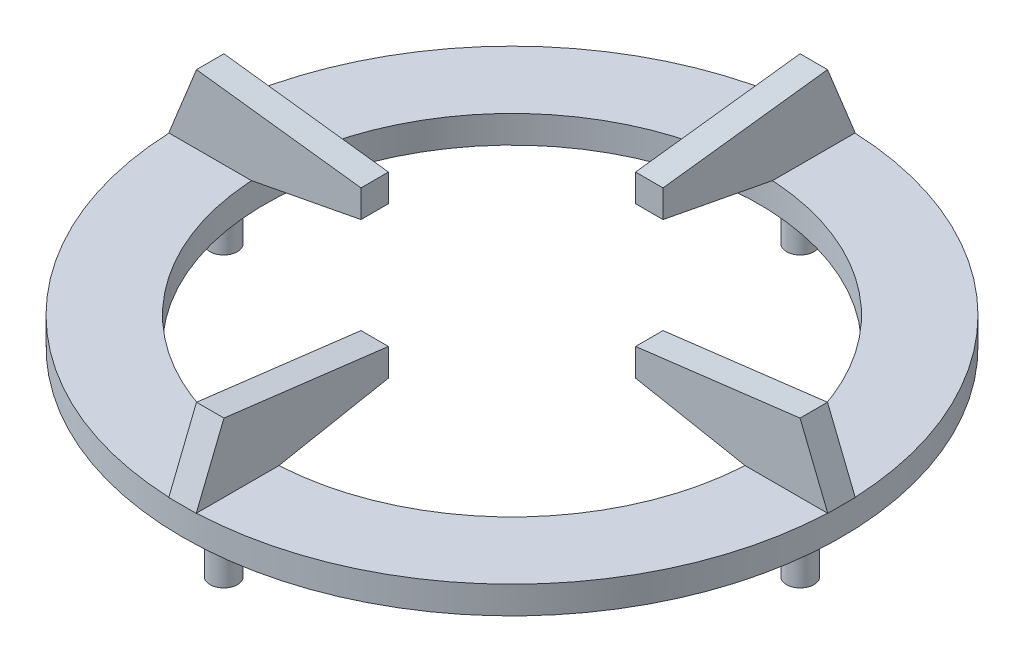
ISO-10303-21;
HEADER;
FILE_DESCRIPTION(('STEP AP214'),'2;1');
FILE_NAME('part.step','',(''),(''),'','','');
FILE_SCHEMA(('AUTOMOTIVE_DESIGN { 1 0 10303 214 1 1 1 1 }'));
ENDSEC;
DATA;
#1=APPLICATION_CONTEXT('core data for automotive mechanical design processes');
#2=APPLICATION_PROTOCOL_DEFINITION('international standard','automotive_design',2000,#1);
#3=PRODUCT_CONTEXT('',#1,'mechanical');
#4=PRODUCT('Part','Part','',(#3));
#5=PRODUCT_RELATED_PRODUCT_CATEGORY('part','',(#4));
#6=PRODUCT_DEFINITION_FORMATION('','',#4);
#7=PRODUCT_DEFINITION_CONTEXT('part definition',#1,'design');
#8=PRODUCT_DEFINITION('design','',#6,#7);
#9=PRODUCT_DEFINITION_SHAPE('','',#8);
#10=(LENGTH_UNIT() NAMED_UNIT(*) SI_UNIT(.MILLI.,.METRE.));
#11=(NAMED_UNIT(*) PLANE_ANGLE_UNIT() SI_UNIT($,.RADIAN.));
#12=(NAMED_UNIT(*) SI_UNIT($,.STERADIAN.) SOLID_ANGLE_UNIT());
#13=UNCERTAINTY_MEASURE_WITH_UNIT(LENGTH_MEASURE(1.E-05),#10,'distance_accuracy_value','');
#14=(GEOMETRIC_REPRESENTATION_CONTEXT(3) GLOBAL_UNCERTAINTY_ASSIGNED_CONTEXT((#13)) GLOBAL_UNIT_ASSIGNED_CONTEXT((#10,
#11,#12)) REPRESENTATION_CONTEXT('',''));
#15=CARTESIAN_POINT('',(0.,0.,0.));
#16=DIRECTION('',(0.,0.,1.));
#17=DIRECTION('',(1.,0.,0.));
#18=AXIS2_PLACEMENT_3D('',#15,#16,#17);
#19=CARTESIAN_POINT('',(0.,2.,0.));
#20=DIRECTION('',(0.,1.,0.));
#21=DIRECTION('',(0.,0.,1.));
#22=AXIS2_PLACEMENT_3D('',#19,#20,#21);
#23=PLANE('',#22);
#24=DIRECTION('',(0.,0.,-1.));
#25=VECTOR('',#24,1.);
#26=CARTESIAN_POINT('',(-1.,1.99999999999999,18.));
#27=LINE('',#26,#25);
#28=CARTESIAN_POINT('',(-1.,2.,23.9791576165636));
#29=VERTEX_POINT('',#28);
#30=CARTESIAN_POINT('',(-1.,2.,18.));
#31=VERTEX_POINT('',#30);
#32=EDGE_CURVE('E68',#29,#31,#27,.T.);
#33=ORIENTED_EDGE('',*,*,#32,.T.);
#34=DIRECTION('',(1.,0.,0.));
#35=VECTOR('',#34,1.);
#36=CARTESIAN_POINT('',(-1.,1.99999999999999,18.));
#37=LINE('',#36,#35);
#38=CARTESIAN_POINT('',(0.,2.,18.));
#39=VERTEX_POINT('',#38);
#40=EDGE_CURVE('E265',#31,#39,#37,.T.);
#41=ORIENTED_EDGE('',*,*,#40,.T.);
#42=CARTESIAN_POINT('',(0.,2.,0.));
#43=DIRECTION('',(0.,1.,0.));
#44=DIRECTION('',(0.,0.,1.));
#45=AXIS2_PLACEMENT_3D('',#42,#43,#44);
#46=CIRCLE('',#45,18.);
#47=CARTESIAN_POINT('',(-18.,2.,0.));
#48=VERTEX_POINT('',#47);
#49=EDGE_CURVE('E506',#48,#39,#46,.T.);
#50=ORIENTED_EDGE('',*,*,#49,.F.);
#51=DIRECTION('',(0.,0.,1.));
#52=VECTOR('',#51,1.);
#53=CARTESIAN_POINT('',(-18.,2.00000000000001,-1.));
#54=LINE('',#53,#52);
#55=CARTESIAN_POINT('',(-18.,2.,1.));
#56=VERTEX_POINT('',#55);
#57=EDGE_CURVE('E387',#48,#56,#54,.T.);
#58=ORIENTED_EDGE('',*,*,#57,.T.);
#59=DIRECTION('',(1.,0.,0.));
#60=VECTOR('',#59,1.);
#61=CARTESIAN_POINT('',(-18.,2.00000000000001,1.));
#62=LINE('',#61,#60);
#63=CARTESIAN_POINT('',(-23.9791576165636,2.,1.));
#64=VERTEX_POINT('',#63);
#65=EDGE_CURVE('E415',#64,#56,#62,.T.);
#66=ORIENTED_EDGE('',*,*,#65,.F.);
#67=CARTESIAN_POINT('',(0.,2.,0.));
#68=DIRECTION('',(0.,1.,0.));
#69=DIRECTION('',(0.,0.,1.));
#70=AXIS2_PLACEMENT_3D('',#67,#68,#69);
#71=CIRCLE('',#70,24.);
#72=EDGE_CURVE('E785',#64,#29,#71,.T.);
#73=ORIENTED_EDGE('',*,*,#72,.T.);
#74=EDGE_LOOP('',(#33,#41,#50,#58,#66,#73));
#75=FACE_BOUND('',#74,.T.);
#76=ADVANCED_FACE('F52',(#75),#23,.T.);
#77=DIRECTION('',(0.,0.,-1.));
#78=VECTOR('',#77,1.);
#79=CARTESIAN_POINT('',(-1.,2.,-18.));
#80=LINE('',#79,#78);
#81=CARTESIAN_POINT('',(-1.,2.,-18.));
#82=VERTEX_POINT('',#81);
#83=CARTESIAN_POINT('',(-1.,2.,-23.9791576165636));
#84=VERTEX_POINT('',#83);
#85=EDGE_CURVE('E328',#82,#84,#80,.T.);
#86=ORIENTED_EDGE('',*,*,#85,.T.);
#87=CARTESIAN_POINT('',(-23.9791576165636,2.,-1.));
#88=VERTEX_POINT('',#87);
#89=EDGE_CURVE('E594',#84,#88,#71,.T.);
#90=ORIENTED_EDGE('',*,*,#89,.T.);
#91=DIRECTION('',(1.,0.,0.));
#92=VECTOR('',#91,1.);
#93=CARTESIAN_POINT('',(-18.,2.00000000000001,-1.));
#94=LINE('',#93,#92);
#95=CARTESIAN_POINT('',(-18.,2.,-1.));
#96=VERTEX_POINT('',#95);
#97=EDGE_CURVE('E394',#88,#96,#94,.T.);
#98=ORIENTED_EDGE('',*,*,#97,.T.);
#99=EDGE_CURVE('E383',#96,#48,#54,.T.);
#100=ORIENTED_EDGE('',*,*,#99,.T.);
#101=CARTESIAN_POINT('',(0.,2.,-18.));
#102=VERTEX_POINT('',#101);
#103=EDGE_CURVE('E504',#102,#48,#46,.T.);
#104=ORIENTED_EDGE('',*,*,#103,.F.);
#105=DIRECTION('',(1.,0.,0.));
#106=VECTOR('',#105,1.);
#107=CARTESIAN_POINT('',(-1.,2.,-18.));
#108=LINE('',#107,#106);
#109=EDGE_CURVE('E349',#82,#102,#108,.T.);
#110=ORIENTED_EDGE('',*,*,#109,.F.);
#111=EDGE_LOOP('',(#86,#90,#98,#100,#104,#110));
#112=FACE_BOUND('',#111,.T.);
#113=ADVANCED_FACE('F559',(#112),#23,.T.);
#114=CARTESIAN_POINT('',(1.,2.,-18.));
#115=VERTEX_POINT('',#114);
#116=EDGE_CURVE('E354',#102,#115,#108,.T.);
#117=ORIENTED_EDGE('',*,*,#116,.F.);
#118=CARTESIAN_POINT('',(18.,2.,0.));
#119=VERTEX_POINT('',#118);
#120=EDGE_CURVE('E499',#119,#102,#46,.T.);
#121=ORIENTED_EDGE('',*,*,#120,.F.);
#122=DIRECTION('',(0.,0.,1.));
#123=VECTOR('',#122,1.);
#124=CARTESIAN_POINT('',(18.,2.,-1.));
#125=LINE('',#124,#123);
#126=CARTESIAN_POINT('',(18.,2.,-1.));
#127=VERTEX_POINT('',#126);
#128=EDGE_CURVE('E480',#127,#119,#125,.T.);
#129=ORIENTED_EDGE('',*,*,#128,.F.);
#130=DIRECTION('',(1.,0.,0.));
#131=VECTOR('',#130,1.);
#132=CARTESIAN_POINT('',(18.,2.,-1.));
#133=LINE('',#132,#131);
#134=CARTESIAN_POINT('',(23.9791576165636,2.,-1.));
#135=VERTEX_POINT('',#134);
#136=EDGE_CURVE('E459',#127,#135,#133,.T.);
#137=ORIENTED_EDGE('',*,*,#136,.T.);
#138=CARTESIAN_POINT('',(1.,2.,-23.9791576165636));
#139=VERTEX_POINT('',#138);
#140=EDGE_CURVE('E782',#135,#139,#71,.T.);
#141=ORIENTED_EDGE('',*,*,#140,.T.);
#142=DIRECTION('',(0.,0.,-1.));
#143=VECTOR('',#142,1.);
#144=CARTESIAN_POINT('',(1.,2.,-18.));
#145=LINE('',#144,#143);
#146=EDGE_CURVE('E306',#115,#139,#145,.T.);
#147=ORIENTED_EDGE('',*,*,#146,.F.);
#148=EDGE_LOOP('',(#117,#121,#129,#137,#141,#147));
#149=FACE_BOUND('',#148,.T.);
#150=ADVANCED_FACE('F563',(#149),#23,.T.);
#151=CARTESIAN_POINT('',(1.,2.,18.));
#152=VERTEX_POINT('',#151);
#153=EDGE_CURVE('E76',#39,#152,#37,.T.);
#154=ORIENTED_EDGE('',*,*,#153,.T.);
#155=DIRECTION('',(0.,0.,-1.));
#156=VECTOR('',#155,1.);
#157=CARTESIAN_POINT('',(1.,1.99999999999999,18.));
#158=LINE('',#157,#156);
#159=CARTESIAN_POINT('',(1.,2.,23.9791576165636));
#160=VERTEX_POINT('',#159);
#161=EDGE_CURVE('E287',#160,#152,#158,.T.);
#162=ORIENTED_EDGE('',*,*,#161,.F.);
#163=CARTESIAN_POINT('',(23.9791576165636,2.,1.));
#164=VERTEX_POINT('',#163);
#165=EDGE_CURVE('E514',#160,#164,#71,.T.);
#166=ORIENTED_EDGE('',*,*,#165,.T.);
#167=DIRECTION('',(1.,0.,0.));
#168=VECTOR('',#167,1.);
#169=CARTESIAN_POINT('',(18.,2.,1.));
#170=LINE('',#169,#168);
#171=CARTESIAN_POINT('',(18.,2.,1.));
#172=VERTEX_POINT('',#171);
#173=EDGE_CURVE('E437',#172,#164,#170,.T.);
#174=ORIENTED_EDGE('',*,*,#173,.F.);
#175=EDGE_CURVE('E486',#119,#172,#125,.T.);
#176=ORIENTED_EDGE('',*,*,#175,.F.);
#177=EDGE_CURVE('E505',#39,#119,#46,.T.);
#178=ORIENTED_EDGE('',*,*,#177,.F.);
#179=EDGE_LOOP('',(#154,#162,#166,#174,#176,#178));
#180=FACE_BOUND('',#179,.T.);
#181=ADVANCED_FACE('F534',(#180),#23,.T.);
#182=CARTESIAN_POINT('',(0.,0.,0.));
#183=DIRECTION('',(0.,1.,0.));
#184=DIRECTION('',(0.,0.,1.));
#185=AXIS2_PLACEMENT_3D('',#182,#183,#184);
#186=PLANE('',#185);
#187=CARTESIAN_POINT('',(-21.,0.,0.));
#188=DIRECTION('',(0.,1.,0.));
#189=DIRECTION('',(0.,0.,1.));
#190=AXIS2_PLACEMENT_3D('',#187,#188,#189);
#191=CIRCLE('',#190,1.);
#192=CARTESIAN_POINT('',(-21.,0.,1.));
#193=VERTEX_POINT('',#192);
#194=EDGE_CURVE('E12',#193,#193,#191,.F.);
#195=ORIENTED_EDGE('',*,*,#194,.F.);
#196=EDGE_LOOP('',(#195));
#197=FACE_BOUND('',#196,.T.);
#198=CARTESIAN_POINT('',(0.,0.,-21.));
#199=DIRECTION('',(0.,1.,0.));
#200=DIRECTION('',(0.,0.,1.));
#201=AXIS2_PLACEMENT_3D('',#198,#199,#200);
#202=CIRCLE('',#201,1.);
#203=CARTESIAN_POINT('',(0.,0.,-20.));
#204=VERTEX_POINT('',#203);
#205=EDGE_CURVE('E61',#204,#204,#202,.F.);
#206=ORIENTED_EDGE('',*,*,#205,.F.);
#207=EDGE_LOOP('',(#206));
#208=FACE_BOUND('',#207,.T.);
#209=CARTESIAN_POINT('',(21.,0.,0.));
#210=DIRECTION('',(0.,1.,0.));
#211=DIRECTION('',(0.,0.,1.));
#212=AXIS2_PLACEMENT_3D('',#209,#210,#211);
#213=CIRCLE('',#212,1.);
#214=CARTESIAN_POINT('',(21.,0.,1.));
#215=VERTEX_POINT('',#214);
#216=EDGE_CURVE('E522',#215,#215,#213,.F.);
#217=ORIENTED_EDGE('',*,*,#216,.F.);
#218=EDGE_LOOP('',(#217));
#219=FACE_BOUND('',#218,.T.);
#220=CARTESIAN_POINT('',(0.,0.,21.));
#221=DIRECTION('',(0.,1.,0.));
#222=DIRECTION('',(0.,0.,1.));
#223=AXIS2_PLACEMENT_3D('',#220,#221,#222);
#224=CIRCLE('',#223,1.);
#225=CARTESIAN_POINT('',(0.,0.,22.));
#226=VERTEX_POINT('',#225);
#227=EDGE_CURVE('E518',#226,#226,#224,.F.);
#228=ORIENTED_EDGE('',*,*,#227,.F.);
#229=EDGE_LOOP('',(#228));
#230=FACE_BOUND('',#229,.T.);
#231=CARTESIAN_POINT('',(0.,0.,0.));
#232=DIRECTION('',(0.,1.,0.));
#233=DIRECTION('',(0.,0.,1.));
#234=AXIS2_PLACEMENT_3D('',#231,#232,#233);
#235=CIRCLE('',#234,24.);
#236=CARTESIAN_POINT('',(0.,0.,24.));
#237=VERTEX_POINT('',#236);
#238=EDGE_CURVE('E503',#237,#237,#235,.T.);
#239=ORIENTED_EDGE('',*,*,#238,.F.);
#240=EDGE_LOOP('',(#239));
#241=FACE_BOUND('',#240,.T.);
#242=CARTESIAN_POINT('',(0.,0.,0.));
#243=DIRECTION('',(0.,1.,0.));
#244=DIRECTION('',(0.,0.,1.));
#245=AXIS2_PLACEMENT_3D('',#242,#243,#244);
#246=CIRCLE('',#245,18.);
#247=CARTESIAN_POINT('',(0.,0.,18.));
#248=VERTEX_POINT('',#247);
#249=EDGE_CURVE('E484',#248,#248,#246,.T.);
#250=ORIENTED_EDGE('',*,*,#249,.T.);
#251=EDGE_LOOP('',(#250));
#252=FACE_BOUND('',#251,.T.);
#253=ADVANCED_FACE('F531',(#197,#208,#219,#230,#241,#252),#186,.F.);
#254=CARTESIAN_POINT('',(0.,2.,0.));
#255=DIRECTION('',(0.,-1.,0.));
#256=DIRECTION('',(0.,0.,-1.));
#257=AXIS2_PLACEMENT_3D('',#254,#255,#256);
#258=CYLINDRICAL_SURFACE('',#257,24.);
#259=CARTESIAN_POINT('',(24.,2.,0.));
#260=VERTEX_POINT('',#259);
#261=EDGE_CURVE('E510',#164,#260,#71,.T.);
#262=ORIENTED_EDGE('',*,*,#261,.F.);
#263=ORIENTED_EDGE('',*,*,#165,.F.);
#264=CARTESIAN_POINT('',(0.,1.99999999999999,0.));
#265=DIRECTION('',(0.,-1.,0.));
#266=DIRECTION('',(0.,0.,-1.));
#267=AXIS2_PLACEMENT_3D('',#264,#265,#266);
#268=CIRCLE('',#267,24.);
#269=CARTESIAN_POINT('',(0.,1.99999999999999,24.));
#270=VERTEX_POINT('',#269);
#271=EDGE_CURVE('E305',#160,#270,#268,.T.);
#272=ORIENTED_EDGE('',*,*,#271,.T.);
#273=EDGE_CURVE('E302',#270,#29,#268,.T.);
#274=ORIENTED_EDGE('',*,*,#273,.T.);
#275=ORIENTED_EDGE('',*,*,#72,.F.);
#276=CARTESIAN_POINT('',(0.,2.00000000000001,0.));
#277=DIRECTION('',(0.,-1.,0.));
#278=DIRECTION('',(0.,0.,-1.));
#279=AXIS2_PLACEMENT_3D('',#276,#277,#278);
#280=CIRCLE('',#279,24.);
#281=CARTESIAN_POINT('',(-24.,2.00000000000002,0.));
#282=VERTEX_POINT('',#281);
#283=EDGE_CURVE('E436',#64,#282,#280,.T.);
#284=ORIENTED_EDGE('',*,*,#283,.T.);
#285=EDGE_CURVE('E432',#282,#88,#280,.T.);
#286=ORIENTED_EDGE('',*,*,#285,.T.);
#287=ORIENTED_EDGE('',*,*,#89,.F.);
#288=CARTESIAN_POINT('',(0.,2.,0.));
#289=DIRECTION('',(0.,-1.,0.));
#290=DIRECTION('',(0.,0.,-1.));
#291=AXIS2_PLACEMENT_3D('',#288,#289,#290);
#292=CIRCLE('',#291,24.);
#293=CARTESIAN_POINT('',(0.,2.,-24.));
#294=VERTEX_POINT('',#293);
#295=EDGE_CURVE('E353',#84,#294,#292,.T.);
#296=ORIENTED_EDGE('',*,*,#295,.T.);
#297=EDGE_CURVE('E370',#294,#139,#292,.T.);
#298=ORIENTED_EDGE('',*,*,#297,.T.);
#299=ORIENTED_EDGE('',*,*,#140,.F.);
#300=EDGE_CURVE('E513',#260,#135,#71,.T.);
#301=ORIENTED_EDGE('',*,*,#300,.F.);
#302=EDGE_LOOP('',(#262,#263,#272,#274,#275,#284,#286,#287,#296,#298,#299,#301));
#303=FACE_BOUND('',#302,.T.);
#304=ORIENTED_EDGE('',*,*,#238,.T.);
#305=EDGE_LOOP('',(#304));
#306=FACE_BOUND('',#305,.T.);
#307=ADVANCED_FACE('F54',(#303,#306),#258,.T.);
#308=CARTESIAN_POINT('',(0.,2.,0.));
#309=DIRECTION('',(0.,-1.,0.));
#310=DIRECTION('',(0.,0.,-1.));
#311=AXIS2_PLACEMENT_3D('',#308,#309,#310);
#312=CYLINDRICAL_SURFACE('',#311,18.);
#313=ORIENTED_EDGE('',*,*,#120,.T.);
#314=ORIENTED_EDGE('',*,*,#103,.T.);
#315=ORIENTED_EDGE('',*,*,#49,.T.);
#316=ORIENTED_EDGE('',*,*,#177,.T.);
#317=EDGE_LOOP('',(#313,#314,#315,#316));
#318=FACE_BOUND('',#317,.T.);
#319=ORIENTED_EDGE('',*,*,#249,.F.);
#320=EDGE_LOOP('',(#319));
#321=FACE_BOUND('',#320,.T.);
#322=ADVANCED_FACE('F544',(#318,#321),#312,.F.);
#323=CARTESIAN_POINT('',(18.,2.,-1.));
#324=DIRECTION('',(0.,-1.,0.));
#325=DIRECTION('',(0.,0.,-1.));
#326=AXIS2_PLACEMENT_3D('',#323,#324,#325);
#327=PLANE('',#326);
#328=CARTESIAN_POINT('',(24.,2.,1.));
#329=VERTEX_POINT('',#328);
#330=EDGE_CURVE('E442',#164,#329,#170,.T.);
#331=ORIENTED_EDGE('',*,*,#330,.F.);
#332=ORIENTED_EDGE('',*,*,#261,.T.);
#333=DIRECTION('',(0.,0.,1.));
#334=VECTOR('',#333,1.);
#335=CARTESIAN_POINT('',(24.,2.,-1.));
#336=LINE('',#335,#334);
#337=EDGE_CURVE('E479',#260,#329,#336,.T.);
#338=ORIENTED_EDGE('',*,*,#337,.T.);
#339=EDGE_LOOP('',(#331,#332,#338));
#340=FACE_BOUND('',#339,.T.);
#341=ADVANCED_FACE('F546',(#340),#327,.T.);
#342=CARTESIAN_POINT('',(24.,2.,-1.));
#343=VERTEX_POINT('',#342);
#344=EDGE_CURVE('E495',#343,#260,#336,.T.);
#345=ORIENTED_EDGE('',*,*,#344,.T.);
#346=ORIENTED_EDGE('',*,*,#300,.T.);
#347=EDGE_CURVE('E458',#135,#343,#133,.T.);
#348=ORIENTED_EDGE('',*,*,#347,.T.);
#349=EDGE_LOOP('',(#345,#346,#348));
#350=FACE_BOUND('',#349,.T.);
#351=ADVANCED_FACE('F553',(#350),#327,.T.);
#352=CARTESIAN_POINT('',(9.99999999999999,3.52905706102146,-1.));
#353=DIRECTION('',(-0.187733793049435,-0.98221994631919,0.));
#354=DIRECTION('',(0.98221994631919,-0.187733793049435,0.));
#355=AXIS2_PLACEMENT_3D('',#352,#353,#354);
#356=PLANE('',#355);
#357=ORIENTED_EDGE('',*,*,#128,.T.);
#358=ORIENTED_EDGE('',*,*,#175,.T.);
#359=DIRECTION('',(0.98221994631919,-0.187733793049435,0.));
#360=VECTOR('',#359,1.);
#361=CARTESIAN_POINT('',(9.99999999999999,3.52905706102146,1.));
#362=LINE('',#361,#360);
#363=CARTESIAN_POINT('',(9.99999999999999,3.52905706102146,1.));
#364=VERTEX_POINT('',#363);
#365=EDGE_CURVE('E454',#364,#172,#362,.T.);
#366=ORIENTED_EDGE('',*,*,#365,.F.);
#367=DIRECTION('',(0.,0.,1.));
#368=VECTOR('',#367,1.);
#369=CARTESIAN_POINT('',(9.99999999999999,3.52905706102146,-1.));
#370=LINE('',#369,#368);
#371=CARTESIAN_POINT('',(9.99999999999999,3.52905706102146,-1.));
#372=VERTEX_POINT('',#371);
#373=EDGE_CURVE('E485',#372,#364,#370,.T.);
#374=ORIENTED_EDGE('',*,*,#373,.F.);
#375=DIRECTION('',(0.98221994631919,-0.187733793049435,0.));
#376=VECTOR('',#375,1.);
#377=CARTESIAN_POINT('',(9.99999999999999,3.52905706102146,-1.));
#378=LINE('',#377,#376);
#379=EDGE_CURVE('E475',#372,#127,#378,.T.);
#380=ORIENTED_EDGE('',*,*,#379,.T.);
#381=EDGE_LOOP('',(#357,#358,#366,#374,#380));
#382=FACE_BOUND('',#381,.T.);
#383=ADVANCED_FACE('F759',(#382),#356,.T.);
#384=CARTESIAN_POINT('',(9.99999999999999,5.52905706102146,-1.));
#385=DIRECTION('',(-1.,0.,0.));
#386=DIRECTION('',(0.,0.,1.));
#387=AXIS2_PLACEMENT_3D('',#384,#385,#386);
#388=PLANE('',#387);
#389=ORIENTED_EDGE('',*,*,#373,.T.);
#390=DIRECTION('',(0.,-1.,0.));
#391=VECTOR('',#390,1.);
#392=CARTESIAN_POINT('',(9.99999999999999,5.52905706102146,1.));
#393=LINE('',#392,#391);
#394=CARTESIAN_POINT('',(9.99999999999999,5.52905706102146,1.));
#395=VERTEX_POINT('',#394);
#396=EDGE_CURVE('E450',#395,#364,#393,.T.);
#397=ORIENTED_EDGE('',*,*,#396,.F.);
#398=DIRECTION('',(0.,0.,1.));
#399=VECTOR('',#398,1.);
#400=CARTESIAN_POINT('',(9.99999999999999,5.52905706102146,-1.));
#401=LINE('',#400,#399);
#402=CARTESIAN_POINT('',(9.99999999999999,5.52905706102146,-1.));
#403=VERTEX_POINT('',#402);
#404=EDGE_CURVE('E489',#403,#395,#401,.T.);
#405=ORIENTED_EDGE('',*,*,#404,.F.);
#406=DIRECTION('',(0.,-1.,0.));
#407=VECTOR('',#406,1.);
#408=CARTESIAN_POINT('',(9.99999999999999,5.52905706102146,-1.));
#409=LINE('',#408,#407);
#410=EDGE_CURVE('E471',#403,#372,#409,.T.);
#411=ORIENTED_EDGE('',*,*,#410,.T.);
#412=EDGE_LOOP('',(#389,#397,#405,#411));
#413=FACE_BOUND('',#412,.T.);
#414=ADVANCED_FACE('F762',(#413),#388,.T.);
#415=CARTESIAN_POINT('',(21.9798688708242,7.,-1.));
#416=DIRECTION('',(-0.121869343405148,0.992546151641322,0.));
#417=DIRECTION('',(-0.992546151641322,-0.121869343405148,0.));
#418=AXIS2_PLACEMENT_3D('',#415,#416,#417);
#419=PLANE('',#418);
#420=ORIENTED_EDGE('',*,*,#404,.T.);
#421=DIRECTION('',(-0.992546151641322,-0.121869343405148,0.));
#422=VECTOR('',#421,1.);
#423=CARTESIAN_POINT('',(21.9798688708242,7.,1.));
#424=LINE('',#423,#422);
#425=CARTESIAN_POINT('',(21.9798688708242,7.,1.));
#426=VERTEX_POINT('',#425);
#427=EDGE_CURVE('E446',#426,#395,#424,.T.);
#428=ORIENTED_EDGE('',*,*,#427,.F.);
#429=DIRECTION('',(0.,0.,1.));
#430=VECTOR('',#429,1.);
#431=CARTESIAN_POINT('',(21.9798688708242,7.,-1.));
#432=LINE('',#431,#430);
#433=CARTESIAN_POINT('',(21.9798688708242,7.,-1.));
#434=VERTEX_POINT('',#433);
#435=EDGE_CURVE('E492',#434,#426,#432,.T.);
#436=ORIENTED_EDGE('',*,*,#435,.F.);
#437=DIRECTION('',(-0.992546151641322,-0.121869343405148,0.));
#438=VECTOR('',#437,1.);
#439=CARTESIAN_POINT('',(21.9798688708242,7.,-1.));
#440=LINE('',#439,#438);
#441=EDGE_CURVE('E467',#434,#403,#440,.T.);
#442=ORIENTED_EDGE('',*,*,#441,.T.);
#443=EDGE_LOOP('',(#420,#428,#436,#442));
#444=FACE_BOUND('',#443,.T.);
#445=ADVANCED_FACE('F766',(#444),#419,.T.);
#446=CARTESIAN_POINT('',(24.,2.,-1.));
#447=DIRECTION('',(0.927183854566788,0.37460659341591,0.));
#448=DIRECTION('',(-0.37460659341591,0.927183854566789,0.));
#449=AXIS2_PLACEMENT_3D('',#446,#447,#448);
#450=PLANE('',#449);
#451=ORIENTED_EDGE('',*,*,#435,.T.);
#452=DIRECTION('',(-0.37460659341591,0.927183854566788,0.));
#453=VECTOR('',#452,1.);
#454=CARTESIAN_POINT('',(24.,2.,1.));
#455=LINE('',#454,#453);
#456=EDGE_CURVE('E441',#329,#426,#455,.T.);
#457=ORIENTED_EDGE('',*,*,#456,.F.);
#458=ORIENTED_EDGE('',*,*,#337,.F.);
#459=ORIENTED_EDGE('',*,*,#344,.F.);
#460=DIRECTION('',(-0.37460659341591,0.927183854566788,0.));
#461=VECTOR('',#460,1.);
#462=CARTESIAN_POINT('',(24.,2.,-1.));
#463=LINE('',#462,#461);
#464=EDGE_CURVE('E463',#343,#434,#463,.T.);
#465=ORIENTED_EDGE('',*,*,#464,.T.);
#466=EDGE_LOOP('',(#451,#457,#458,#459,#465));
#467=FACE_BOUND('',#466,.T.);
#468=ADVANCED_FACE('F757',(#467),#450,.T.);
#469=CARTESIAN_POINT('',(0.,0.,-1.));
#470=DIRECTION('',(0.,0.,-1.));
#471=DIRECTION('',(-1.,0.,0.));
#472=AXIS2_PLACEMENT_3D('',#469,#470,#471);
#473=PLANE('',#472);
#474=ORIENTED_EDGE('',*,*,#136,.F.);
#475=ORIENTED_EDGE('',*,*,#379,.F.);
#476=ORIENTED_EDGE('',*,*,#410,.F.);
#477=ORIENTED_EDGE('',*,*,#441,.F.);
#478=ORIENTED_EDGE('',*,*,#464,.F.);
#479=ORIENTED_EDGE('',*,*,#347,.F.);
#480=EDGE_LOOP('',(#474,#475,#476,#477,#478,#479));
#481=FACE_BOUND('',#480,.T.);
#482=ADVANCED_FACE('F753',(#481),#473,.T.);
#483=CARTESIAN_POINT('',(0.,0.,1.));
#484=DIRECTION('',(0.,0.,-1.));
#485=DIRECTION('',(-1.,0.,0.));
#486=AXIS2_PLACEMENT_3D('',#483,#484,#485);
#487=PLANE('',#486);
#488=ORIENTED_EDGE('',*,*,#173,.T.);
#489=ORIENTED_EDGE('',*,*,#330,.T.);
#490=ORIENTED_EDGE('',*,*,#456,.T.);
#491=ORIENTED_EDGE('',*,*,#427,.T.);
#492=ORIENTED_EDGE('',*,*,#396,.T.);
#493=ORIENTED_EDGE('',*,*,#365,.T.);
#494=EDGE_LOOP('',(#488,#489,#490,#491,#492,#493));
#495=FACE_BOUND('',#494,.T.);
#496=ADVANCED_FACE('F750',(#495),#487,.F.);
#497=CARTESIAN_POINT('',(-18.,2.00000000000001,-1.));
#498=DIRECTION('',(0.,-1.,0.));
#499=DIRECTION('',(0.,0.,-1.));
#500=AXIS2_PLACEMENT_3D('',#497,#498,#499);
#501=PLANE('',#500);
#502=ORIENTED_EDGE('',*,*,#283,.F.);
#503=CARTESIAN_POINT('',(-24.,2.00000000000001,1.));
#504=VERTEX_POINT('',#503);
#505=EDGE_CURVE('E416',#504,#64,#62,.T.);
#506=ORIENTED_EDGE('',*,*,#505,.F.);
#507=DIRECTION('',(0.,0.,1.));
#508=VECTOR('',#507,1.);
#509=CARTESIAN_POINT('',(-24.,2.00000000000001,-1.));
#510=LINE('',#509,#508);
#511=EDGE_CURVE('E382',#282,#504,#510,.T.);
#512=ORIENTED_EDGE('',*,*,#511,.F.);
#513=EDGE_LOOP('',(#502,#506,#512));
#514=FACE_BOUND('',#513,.T.);
#515=ADVANCED_FACE('F725',(#514),#501,.T.);
#516=CARTESIAN_POINT('',(-9.99999999999999,5.52905706102146,-1.));
#517=DIRECTION('',(1.,0.,0.));
#518=DIRECTION('',(0.,0.,-1.));
#519=AXIS2_PLACEMENT_3D('',#516,#517,#518);
#520=PLANE('',#519);
#521=DIRECTION('',(0.,0.,1.));
#522=VECTOR('',#521,1.);
#523=CARTESIAN_POINT('',(-9.99999999999999,5.52905706102146,-1.));
#524=LINE('',#523,#522);
#525=CARTESIAN_POINT('',(-9.99999999999999,5.52905706102146,-1.));
#526=VERTEX_POINT('',#525);
#527=CARTESIAN_POINT('',(-9.99999999999999,5.52905706102146,1.));
#528=VERTEX_POINT('',#527);
#529=EDGE_CURVE('E371',#526,#528,#524,.T.);
#530=ORIENTED_EDGE('',*,*,#529,.T.);
#531=DIRECTION('',(0.,1.,0.));
#532=VECTOR('',#531,1.);
#533=CARTESIAN_POINT('',(-9.99999999999999,5.52905706102146,1.));
#534=LINE('',#533,#532);
#535=CARTESIAN_POINT('',(-9.99999999999999,3.52905706102147,1.));
#536=VERTEX_POINT('',#535);
#537=EDGE_CURVE('E428',#536,#528,#534,.T.);
#538=ORIENTED_EDGE('',*,*,#537,.F.);
#539=DIRECTION('',(0.,0.,1.));
#540=VECTOR('',#539,1.);
#541=CARTESIAN_POINT('',(-9.99999999999999,3.52905706102147,-1.));
#542=LINE('',#541,#540);
#543=CARTESIAN_POINT('',(-9.99999999999999,3.52905706102147,-1.));
#544=VERTEX_POINT('',#543);
#545=EDGE_CURVE('E388',#544,#536,#542,.T.);
#546=ORIENTED_EDGE('',*,*,#545,.F.);
#547=DIRECTION('',(0.,1.,0.));
#548=VECTOR('',#547,1.);
#549=CARTESIAN_POINT('',(-9.99999999999999,5.52905706102146,-1.));
#550=LINE('',#549,#548);
#551=EDGE_CURVE('E407',#544,#526,#550,.T.);
#552=ORIENTED_EDGE('',*,*,#551,.T.);
#553=EDGE_LOOP('',(#530,#538,#546,#552));
#554=FACE_BOUND('',#553,.T.);
#555=ADVANCED_FACE('F721',(#554),#520,.T.);
#556=CARTESIAN_POINT('',(-9.99999999999999,3.52905706102147,-1.));
#557=DIRECTION('',(0.187733793049435,-0.98221994631919,0.));
#558=DIRECTION('',(0.98221994631919,0.187733793049435,0.));
#559=AXIS2_PLACEMENT_3D('',#556,#557,#558);
#560=PLANE('',#559);
#561=ORIENTED_EDGE('',*,*,#545,.T.);
#562=DIRECTION('',(0.98221994631919,0.187733793049435,0.));
#563=VECTOR('',#562,1.);
#564=CARTESIAN_POINT('',(-9.99999999999999,3.52905706102147,1.));
#565=LINE('',#564,#563);
#566=EDGE_CURVE('E411',#56,#536,#565,.T.);
#567=ORIENTED_EDGE('',*,*,#566,.F.);
#568=ORIENTED_EDGE('',*,*,#57,.F.);
#569=ORIENTED_EDGE('',*,*,#99,.F.);
#570=DIRECTION('',(0.98221994631919,0.187733793049435,0.));
#571=VECTOR('',#570,1.);
#572=CARTESIAN_POINT('',(-9.99999999999999,3.52905706102147,-1.));
#573=LINE('',#572,#571);
#574=EDGE_CURVE('E374',#96,#544,#573,.T.);
#575=ORIENTED_EDGE('',*,*,#574,.T.);
#576=EDGE_LOOP('',(#561,#567,#568,#569,#575));
#577=FACE_BOUND('',#576,.T.);
#578=ADVANCED_FACE('F724',(#577),#560,.T.);
#579=ORIENTED_EDGE('',*,*,#285,.F.);
#580=CARTESIAN_POINT('',(-24.,2.00000000000001,-1.));
#581=VERTEX_POINT('',#580);
#582=EDGE_CURVE('E378',#581,#282,#510,.T.);
#583=ORIENTED_EDGE('',*,*,#582,.F.);
#584=EDGE_CURVE('E395',#581,#88,#94,.T.);
#585=ORIENTED_EDGE('',*,*,#584,.T.);
#586=EDGE_LOOP('',(#579,#583,#585));
#587=FACE_BOUND('',#586,.T.);
#588=ADVANCED_FACE('F735',(#587),#501,.T.);
#589=CARTESIAN_POINT('',(-24.,2.00000000000001,-1.));
#590=DIRECTION('',(-0.927183854566788,0.37460659341591,0.));
#591=DIRECTION('',(-0.37460659341591,-0.927183854566788,0.));
#592=AXIS2_PLACEMENT_3D('',#589,#590,#591);
#593=PLANE('',#592);
#594=ORIENTED_EDGE('',*,*,#582,.T.);
#595=ORIENTED_EDGE('',*,*,#511,.T.);
#596=DIRECTION('',(-0.37460659341591,-0.927183854566788,0.));
#597=VECTOR('',#596,1.);
#598=CARTESIAN_POINT('',(-24.,2.00000000000001,1.));
#599=LINE('',#598,#597);
#600=CARTESIAN_POINT('',(-21.9798688708242,7.,1.));
#601=VERTEX_POINT('',#600);
#602=EDGE_CURVE('E420',#601,#504,#599,.T.);
#603=ORIENTED_EDGE('',*,*,#602,.F.);
#604=DIRECTION('',(0.,0.,1.));
#605=VECTOR('',#604,1.);
#606=CARTESIAN_POINT('',(-21.9798688708242,7.,-1.));
#607=LINE('',#606,#605);
#608=CARTESIAN_POINT('',(-21.9798688708242,7.,-1.));
#609=VERTEX_POINT('',#608);
#610=EDGE_CURVE('E375',#609,#601,#607,.T.);
#611=ORIENTED_EDGE('',*,*,#610,.F.);
#612=DIRECTION('',(-0.37460659341591,-0.927183854566788,0.));
#613=VECTOR('',#612,1.);
#614=CARTESIAN_POINT('',(-24.,2.00000000000001,-1.));
#615=LINE('',#614,#613);
#616=EDGE_CURVE('E399',#609,#581,#615,.T.);
#617=ORIENTED_EDGE('',*,*,#616,.T.);
#618=EDGE_LOOP('',(#594,#595,#603,#611,#617));
#619=FACE_BOUND('',#618,.T.);
#620=ADVANCED_FACE('F731',(#619),#593,.T.);
#621=CARTESIAN_POINT('',(-21.9798688708242,7.,-1.));
#622=DIRECTION('',(0.121869343405148,0.992546151641322,0.));
#623=DIRECTION('',(-0.992546151641322,0.121869343405148,0.));
#624=AXIS2_PLACEMENT_3D('',#621,#622,#623);
#625=PLANE('',#624);
#626=ORIENTED_EDGE('',*,*,#610,.T.);
#627=DIRECTION('',(-0.992546151641322,0.121869343405148,0.));
#628=VECTOR('',#627,1.);
#629=CARTESIAN_POINT('',(-21.9798688708242,7.,1.));
#630=LINE('',#629,#628);
#631=EDGE_CURVE('E424',#528,#601,#630,.T.);
#632=ORIENTED_EDGE('',*,*,#631,.F.);
#633=ORIENTED_EDGE('',*,*,#529,.F.);
#634=DIRECTION('',(-0.992546151641322,0.121869343405148,0.));
#635=VECTOR('',#634,1.);
#636=CARTESIAN_POINT('',(-21.9798688708242,7.,-1.));
#637=LINE('',#636,#635);
#638=EDGE_CURVE('E403',#526,#609,#637,.T.);
#639=ORIENTED_EDGE('',*,*,#638,.T.);
#640=EDGE_LOOP('',(#626,#632,#633,#639));
#641=FACE_BOUND('',#640,.T.);
#642=ADVANCED_FACE('F727',(#641),#625,.T.);
#643=CARTESIAN_POINT('',(0.,0.,-1.));
#644=DIRECTION('',(0.,0.,-1.));
#645=DIRECTION('',(-1.,0.,0.));
#646=AXIS2_PLACEMENT_3D('',#643,#644,#645);
#647=PLANE('',#646);
#648=ORIENTED_EDGE('',*,*,#551,.F.);
#649=ORIENTED_EDGE('',*,*,#574,.F.);
#650=ORIENTED_EDGE('',*,*,#97,.F.);
#651=ORIENTED_EDGE('',*,*,#584,.F.);
#652=ORIENTED_EDGE('',*,*,#616,.F.);
#653=ORIENTED_EDGE('',*,*,#638,.F.);
#654=EDGE_LOOP('',(#648,#649,#650,#651,#652,#653));
#655=FACE_BOUND('',#654,.T.);
#656=ADVANCED_FACE('F730',(#655),#647,.T.);
#657=CARTESIAN_POINT('',(0.,0.,1.));
#658=DIRECTION('',(0.,0.,-1.));
#659=DIRECTION('',(-1.,0.,0.));
#660=AXIS2_PLACEMENT_3D('',#657,#658,#659);
#661=PLANE('',#660);
#662=ORIENTED_EDGE('',*,*,#537,.T.);
#663=ORIENTED_EDGE('',*,*,#631,.T.);
#664=ORIENTED_EDGE('',*,*,#602,.T.);
#665=ORIENTED_EDGE('',*,*,#505,.T.);
#666=ORIENTED_EDGE('',*,*,#65,.T.);
#667=ORIENTED_EDGE('',*,*,#566,.T.);
#668=EDGE_LOOP('',(#662,#663,#664,#665,#666,#667));
#669=FACE_BOUND('',#668,.T.);
#670=ADVANCED_FACE('F745',(#669),#661,.F.);
#671=CARTESIAN_POINT('',(-1.,2.,-18.));
#672=DIRECTION('',(0.,-1.,0.));
#673=DIRECTION('',(0.,0.,-1.));
#674=AXIS2_PLACEMENT_3D('',#671,#672,#673);
#675=PLANE('',#674);
#676=ORIENTED_EDGE('',*,*,#297,.F.);
#677=DIRECTION('',(1.,0.,0.));
#678=VECTOR('',#677,1.);
#679=CARTESIAN_POINT('',(-1.,2.,-24.));
#680=LINE('',#679,#678);
#681=CARTESIAN_POINT('',(1.,2.,-24.));
#682=VERTEX_POINT('',#681);
#683=EDGE_CURVE('E348',#294,#682,#680,.T.);
#684=ORIENTED_EDGE('',*,*,#683,.T.);
#685=EDGE_CURVE('E311',#139,#682,#145,.T.);
#686=ORIENTED_EDGE('',*,*,#685,.F.);
#687=EDGE_LOOP('',(#676,#684,#686));
#688=FACE_BOUND('',#687,.T.);
#689=ADVANCED_FACE('F606',(#688),#675,.T.);
#690=ORIENTED_EDGE('',*,*,#295,.F.);
#691=CARTESIAN_POINT('',(-1.,2.,-24.));
#692=VERTEX_POINT('',#691);
#693=EDGE_CURVE('E327',#84,#692,#80,.T.);
#694=ORIENTED_EDGE('',*,*,#693,.T.);
#695=EDGE_CURVE('E364',#692,#294,#680,.T.);
#696=ORIENTED_EDGE('',*,*,#695,.T.);
#697=EDGE_LOOP('',(#690,#694,#696));
#698=FACE_BOUND('',#697,.T.);
#699=ADVANCED_FACE('F596',(#698),#675,.T.);
#700=CARTESIAN_POINT('',(-1.,3.52905706102147,-9.99999999999999));
#701=DIRECTION('',(0.,-0.98221994631919,0.187733793049436));
#702=DIRECTION('',(0.,-0.187733793049436,-0.98221994631919));
#703=AXIS2_PLACEMENT_3D('',#700,#701,#702);
#704=PLANE('',#703);
#705=ORIENTED_EDGE('',*,*,#109,.T.);
#706=ORIENTED_EDGE('',*,*,#116,.T.);
#707=DIRECTION('',(0.,-0.187733793049436,-0.982219946319189));
#708=VECTOR('',#707,1.);
#709=CARTESIAN_POINT('',(1.,3.52905706102147,-9.99999999999999));
#710=LINE('',#709,#708);
#711=CARTESIAN_POINT('',(1.,3.52905706102147,-9.99999999999999));
#712=VERTEX_POINT('',#711);
#713=EDGE_CURVE('E323',#712,#115,#710,.T.);
#714=ORIENTED_EDGE('',*,*,#713,.F.);
#715=DIRECTION('',(1.,0.,0.));
#716=VECTOR('',#715,1.);
#717=CARTESIAN_POINT('',(-1.,3.52905706102147,-9.99999999999999));
#718=LINE('',#717,#716);
#719=CARTESIAN_POINT('',(-1.,3.52905706102147,-9.99999999999999));
#720=VERTEX_POINT('',#719);
#721=EDGE_CURVE('E355',#720,#712,#718,.T.);
#722=ORIENTED_EDGE('',*,*,#721,.F.);
#723=DIRECTION('',(0.,-0.187733793049436,-0.982219946319189));
#724=VECTOR('',#723,1.);
#725=CARTESIAN_POINT('',(-1.,3.52905706102147,-9.99999999999999));
#726=LINE('',#725,#724);
#727=EDGE_CURVE('E344',#720,#82,#726,.T.);
#728=ORIENTED_EDGE('',*,*,#727,.T.);
#729=EDGE_LOOP('',(#705,#706,#714,#722,#728));
#730=FACE_BOUND('',#729,.T.);
#731=ADVANCED_FACE('F585',(#730),#704,.T.);
#732=CARTESIAN_POINT('',(-1.,5.52905706102147,-9.99999999999999));
#733=DIRECTION('',(0.,0.,1.));
#734=DIRECTION('',(0.,-1.,0.));
#735=AXIS2_PLACEMENT_3D('',#732,#733,#734);
#736=PLANE('',#735);
#737=ORIENTED_EDGE('',*,*,#721,.T.);
#738=DIRECTION('',(0.,-1.,0.));
#739=VECTOR('',#738,1.);
#740=CARTESIAN_POINT('',(1.,5.52905706102147,-9.99999999999999));
#741=LINE('',#740,#739);
#742=CARTESIAN_POINT('',(1.,5.52905706102147,-9.99999999999999));
#743=VERTEX_POINT('',#742);
#744=EDGE_CURVE('E319',#743,#712,#741,.T.);
#745=ORIENTED_EDGE('',*,*,#744,.F.);
#746=DIRECTION('',(1.,0.,0.));
#747=VECTOR('',#746,1.);
#748=CARTESIAN_POINT('',(-1.,5.52905706102147,-9.99999999999999));
#749=LINE('',#748,#747);
#750=CARTESIAN_POINT('',(-1.,5.52905706102147,-9.99999999999999));
#751=VERTEX_POINT('',#750);
#752=EDGE_CURVE('E358',#751,#743,#749,.T.);
#753=ORIENTED_EDGE('',*,*,#752,.F.);
#754=DIRECTION('',(0.,-1.,0.));
#755=VECTOR('',#754,1.);
#756=CARTESIAN_POINT('',(-1.,5.52905706102147,-9.99999999999999));
#757=LINE('',#756,#755);
#758=EDGE_CURVE('E340',#751,#720,#757,.T.);
#759=ORIENTED_EDGE('',*,*,#758,.T.);
#760=EDGE_LOOP('',(#737,#745,#753,#759));
#761=FACE_BOUND('',#760,.T.);
#762=ADVANCED_FACE('F709',(#761),#736,.T.);
#763=CARTESIAN_POINT('',(-1.,7.,-21.9798688708242));
#764=DIRECTION('',(0.,0.992546151641322,0.121869343405147));
#765=DIRECTION('',(0.,-0.121869343405147,0.992546151641322));
#766=AXIS2_PLACEMENT_3D('',#763,#764,#765);
#767=PLANE('',#766);
#768=ORIENTED_EDGE('',*,*,#752,.T.);
#769=DIRECTION('',(0.,-0.121869343405147,0.992546151641322));
#770=VECTOR('',#769,1.);
#771=CARTESIAN_POINT('',(1.,7.,-21.9798688708242));
#772=LINE('',#771,#770);
#773=CARTESIAN_POINT('',(1.,7.,-21.9798688708242));
#774=VERTEX_POINT('',#773);
#775=EDGE_CURVE('E315',#774,#743,#772,.T.);
#776=ORIENTED_EDGE('',*,*,#775,.F.);
#777=DIRECTION('',(1.,0.,0.));
#778=VECTOR('',#777,1.);
#779=CARTESIAN_POINT('',(-1.,7.,-21.9798688708242));
#780=LINE('',#779,#778);
#781=CARTESIAN_POINT('',(-1.,7.,-21.9798688708242));
#782=VERTEX_POINT('',#781);
#783=EDGE_CURVE('E361',#782,#774,#780,.T.);
#784=ORIENTED_EDGE('',*,*,#783,.F.);
#785=DIRECTION('',(0.,-0.121869343405147,0.992546151641322));
#786=VECTOR('',#785,1.);
#787=CARTESIAN_POINT('',(-1.,7.,-21.9798688708242));
#788=LINE('',#787,#786);
#789=EDGE_CURVE('E336',#782,#751,#788,.T.);
#790=ORIENTED_EDGE('',*,*,#789,.T.);
#791=EDGE_LOOP('',(#768,#776,#784,#790));
#792=FACE_BOUND('',#791,.T.);
#793=ADVANCED_FACE('F712',(#792),#767,.T.);
#794=CARTESIAN_POINT('',(-1.,2.,-24.));
#795=DIRECTION('',(0.,0.374606593415909,-0.927183854566789));
#796=DIRECTION('',(0.,0.927183854566789,0.374606593415909));
#797=AXIS2_PLACEMENT_3D('',#794,#795,#796);
#798=PLANE('',#797);
#799=ORIENTED_EDGE('',*,*,#783,.T.);
#800=DIRECTION('',(0.,0.927183854566789,0.374606593415909));
#801=VECTOR('',#800,1.);
#802=CARTESIAN_POINT('',(1.,2.,-24.));
#803=LINE('',#802,#801);
#804=EDGE_CURVE('E310',#682,#774,#803,.T.);
#805=ORIENTED_EDGE('',*,*,#804,.F.);
#806=ORIENTED_EDGE('',*,*,#683,.F.);
#807=ORIENTED_EDGE('',*,*,#695,.F.);
#808=DIRECTION('',(0.,0.927183854566789,0.374606593415909));
#809=VECTOR('',#808,1.);
#810=CARTESIAN_POINT('',(-1.,2.,-24.));
#811=LINE('',#810,#809);
#812=EDGE_CURVE('E332',#692,#782,#811,.T.);
#813=ORIENTED_EDGE('',*,*,#812,.T.);
#814=EDGE_LOOP('',(#799,#805,#806,#807,#813));
#815=FACE_BOUND('',#814,.T.);
#816=ADVANCED_FACE('F610',(#815),#798,.T.);
#817=CARTESIAN_POINT('',(-1.,0.,0.));
#818=DIRECTION('',(-1.,0.,0.));
#819=DIRECTION('',(0.,0.,1.));
#820=AXIS2_PLACEMENT_3D('',#817,#818,#819);
#821=PLANE('',#820);
#822=ORIENTED_EDGE('',*,*,#85,.F.);
#823=ORIENTED_EDGE('',*,*,#727,.F.);
#824=ORIENTED_EDGE('',*,*,#758,.F.);
#825=ORIENTED_EDGE('',*,*,#789,.F.);
#826=ORIENTED_EDGE('',*,*,#812,.F.);
#827=ORIENTED_EDGE('',*,*,#693,.F.);
#828=EDGE_LOOP('',(#822,#823,#824,#825,#826,#827));
#829=FACE_BOUND('',#828,.T.);
#830=ADVANCED_FACE('F589',(#829),#821,.T.);
#831=CARTESIAN_POINT('',(1.,0.,0.));
#832=DIRECTION('',(-1.,0.,0.));
#833=DIRECTION('',(0.,0.,1.));
#834=AXIS2_PLACEMENT_3D('',#831,#832,#833);
#835=PLANE('',#834);
#836=ORIENTED_EDGE('',*,*,#146,.T.);
#837=ORIENTED_EDGE('',*,*,#685,.T.);
#838=ORIENTED_EDGE('',*,*,#804,.T.);
#839=ORIENTED_EDGE('',*,*,#775,.T.);
#840=ORIENTED_EDGE('',*,*,#744,.T.);
#841=ORIENTED_EDGE('',*,*,#713,.T.);
#842=EDGE_LOOP('',(#836,#837,#838,#839,#840,#841));
#843=FACE_BOUND('',#842,.T.);
#844=ADVANCED_FACE('F701',(#843),#835,.F.);
#845=CARTESIAN_POINT('',(-1.,1.99999999999999,18.));
#846=DIRECTION('',(0.,-1.,0.));
#847=DIRECTION('',(0.,0.,-1.));
#848=AXIS2_PLACEMENT_3D('',#845,#846,#847);
#849=PLANE('',#848);
#850=ORIENTED_EDGE('',*,*,#271,.F.);
#851=CARTESIAN_POINT('',(1.,1.99999999999999,24.));
#852=VERTEX_POINT('',#851);
#853=EDGE_CURVE('E288',#852,#160,#158,.T.);
#854=ORIENTED_EDGE('',*,*,#853,.F.);
#855=DIRECTION('',(1.,0.,0.));
#856=VECTOR('',#855,1.);
#857=CARTESIAN_POINT('',(-1.,1.99999999999999,24.));
#858=LINE('',#857,#856);
#859=EDGE_CURVE('E622',#270,#852,#858,.T.);
#860=ORIENTED_EDGE('',*,*,#859,.F.);
#861=EDGE_LOOP('',(#850,#854,#860));
#862=FACE_BOUND('',#861,.T.);
#863=ADVANCED_FACE('F682',(#862),#849,.T.);
#864=CARTESIAN_POINT('',(-1.,5.52905706102146,9.99999999999999));
#865=DIRECTION('',(0.,0.,-1.));
#866=DIRECTION('',(0.,1.,0.));
#867=AXIS2_PLACEMENT_3D('',#864,#865,#866);
#868=PLANE('',#867);
#869=DIRECTION('',(1.,0.,0.));
#870=VECTOR('',#869,1.);
#871=CARTESIAN_POINT('',(-1.,5.52905706102146,9.99999999999999));
#872=LINE('',#871,#870);
#873=CARTESIAN_POINT('',(-1.,5.52905706102146,9.99999999999999));
#874=VERTEX_POINT('',#873);
#875=CARTESIAN_POINT('',(1.,5.52905706102146,9.99999999999999));
#876=VERTEX_POINT('',#875);
#877=EDGE_CURVE('E267',#874,#876,#872,.T.);
#878=ORIENTED_EDGE('',*,*,#877,.T.);
#879=DIRECTION('',(0.,1.,0.));
#880=VECTOR('',#879,1.);
#881=CARTESIAN_POINT('',(1.,5.52905706102146,9.99999999999999));
#882=LINE('',#881,#880);
#883=CARTESIAN_POINT('',(1.,3.52905706102146,9.99999999999999));
#884=VERTEX_POINT('',#883);
#885=EDGE_CURVE('E245',#884,#876,#882,.T.);
#886=ORIENTED_EDGE('',*,*,#885,.F.);
#887=DIRECTION('',(1.,0.,0.));
#888=VECTOR('',#887,1.);
#889=CARTESIAN_POINT('',(-1.,3.52905706102146,9.99999999999999));
#890=LINE('',#889,#888);
#891=CARTESIAN_POINT('',(-1.,3.52905706102146,9.99999999999999));
#892=VERTEX_POINT('',#891);
#893=EDGE_CURVE('E240',#892,#884,#890,.T.);
#894=ORIENTED_EDGE('',*,*,#893,.F.);
#895=DIRECTION('',(0.,1.,0.));
#896=VECTOR('',#895,1.);
#897=CARTESIAN_POINT('',(-1.,5.52905706102146,9.99999999999999));
#898=LINE('',#897,#896);
#899=EDGE_CURVE('E243',#892,#874,#898,.T.);
#900=ORIENTED_EDGE('',*,*,#899,.T.);
#901=EDGE_LOOP('',(#878,#886,#894,#900));
#902=FACE_BOUND('',#901,.T.);
#903=ADVANCED_FACE('F242',(#902),#868,.T.);
#904=CARTESIAN_POINT('',(-1.,3.52905706102146,9.99999999999999));
#905=DIRECTION('',(0.,-0.98221994631919,-0.187733793049436));
#906=DIRECTION('',(0.,0.187733793049436,-0.98221994631919));
#907=AXIS2_PLACEMENT_3D('',#904,#905,#906);
#908=PLANE('',#907);
#909=ORIENTED_EDGE('',*,*,#893,.T.);
#910=DIRECTION('',(0.,0.187733793049436,-0.982219946319189));
#911=VECTOR('',#910,1.);
#912=CARTESIAN_POINT('',(1.,3.52905706102146,9.99999999999999));
#913=LINE('',#912,#911);
#914=EDGE_CURVE('E262',#152,#884,#913,.T.);
#915=ORIENTED_EDGE('',*,*,#914,.F.);
#916=ORIENTED_EDGE('',*,*,#153,.F.);
#917=ORIENTED_EDGE('',*,*,#40,.F.);
#918=DIRECTION('',(0.,0.187733793049436,-0.982219946319189));
#919=VECTOR('',#918,1.);
#920=CARTESIAN_POINT('',(-1.,3.52905706102146,9.99999999999999));
#921=LINE('',#920,#919);
#922=EDGE_CURVE('E257',#31,#892,#921,.T.);
#923=ORIENTED_EDGE('',*,*,#922,.T.);
#924=EDGE_LOOP('',(#909,#915,#916,#917,#923));
#925=FACE_BOUND('',#924,.T.);
#926=ADVANCED_FACE('F264',(#925),#908,.T.);
#927=ORIENTED_EDGE('',*,*,#273,.F.);
#928=CARTESIAN_POINT('',(-1.,1.99999999999999,24.));
#929=VERTEX_POINT('',#928);
#930=EDGE_CURVE('E624',#929,#270,#858,.T.);
#931=ORIENTED_EDGE('',*,*,#930,.F.);
#932=EDGE_CURVE('E271',#929,#29,#27,.T.);
#933=ORIENTED_EDGE('',*,*,#932,.T.);
#934=EDGE_LOOP('',(#927,#931,#933));
#935=FACE_BOUND('',#934,.T.);
#936=ADVANCED_FACE('F690',(#935),#849,.T.);
#937=CARTESIAN_POINT('',(-1.,1.99999999999999,24.));
#938=DIRECTION('',(0.,0.37460659341591,0.927183854566788));
#939=DIRECTION('',(0.,-0.927183854566788,0.37460659341591));
#940=AXIS2_PLACEMENT_3D('',#937,#938,#939);
#941=PLANE('',#940);
#942=ORIENTED_EDGE('',*,*,#930,.T.);
#943=ORIENTED_EDGE('',*,*,#859,.T.);
#944=DIRECTION('',(0.,-0.927183854566788,0.374606593415909));
#945=VECTOR('',#944,1.);
#946=CARTESIAN_POINT('',(1.,1.99999999999999,24.));
#947=LINE('',#946,#945);
#948=CARTESIAN_POINT('',(1.,6.99999999999999,21.9798688708242));
#949=VERTEX_POINT('',#948);
#950=EDGE_CURVE('E292',#949,#852,#947,.T.);
#951=ORIENTED_EDGE('',*,*,#950,.F.);
#952=DIRECTION('',(1.,0.,0.));
#953=VECTOR('',#952,1.);
#954=CARTESIAN_POINT('',(-1.,6.99999999999999,21.9798688708242));
#955=LINE('',#954,#953);
#956=CARTESIAN_POINT('',(-1.,6.99999999999999,21.9798688708242));
#957=VERTEX_POINT('',#956);
#958=EDGE_CURVE('E273',#957,#949,#955,.T.);
#959=ORIENTED_EDGE('',*,*,#958,.F.);
#960=DIRECTION('',(0.,-0.927183854566788,0.374606593415909));
#961=VECTOR('',#960,1.);
#962=CARTESIAN_POINT('',(-1.,1.99999999999999,24.));
#963=LINE('',#962,#961);
#964=EDGE_CURVE('E279',#957,#929,#963,.T.);
#965=ORIENTED_EDGE('',*,*,#964,.T.);
#966=EDGE_LOOP('',(#942,#943,#951,#959,#965));
#967=FACE_BOUND('',#966,.T.);
#968=ADVANCED_FACE('F686',(#967),#941,.T.);
#969=CARTESIAN_POINT('',(-1.,6.99999999999999,21.9798688708242));
#970=DIRECTION('',(0.,0.992546151641322,-0.121869343405147));
#971=DIRECTION('',(0.,0.121869343405147,0.992546151641322));
#972=AXIS2_PLACEMENT_3D('',#969,#970,#971);
#973=PLANE('',#972);
#974=ORIENTED_EDGE('',*,*,#958,.T.);
#975=DIRECTION('',(0.,0.121869343405147,0.992546151641322));
#976=VECTOR('',#975,1.);
#977=CARTESIAN_POINT('',(1.,6.99999999999999,21.9798688708242));
#978=LINE('',#977,#976);
#979=EDGE_CURVE('E296',#876,#949,#978,.T.);
#980=ORIENTED_EDGE('',*,*,#979,.F.);
#981=ORIENTED_EDGE('',*,*,#877,.F.);
#982=DIRECTION('',(0.,0.121869343405147,0.992546151641322));
#983=VECTOR('',#982,1.);
#984=CARTESIAN_POINT('',(-1.,6.99999999999999,21.9798688708242));
#985=LINE('',#984,#983);
#986=EDGE_CURVE('E260',#874,#957,#985,.T.);
#987=ORIENTED_EDGE('',*,*,#986,.T.);
#988=EDGE_LOOP('',(#974,#980,#981,#987));
#989=FACE_BOUND('',#988,.T.);
#990=ADVANCED_FACE('F683',(#989),#973,.T.);
#991=CARTESIAN_POINT('',(-1.,0.,0.));
#992=DIRECTION('',(-1.,0.,0.));
#993=DIRECTION('',(0.,0.,1.));
#994=AXIS2_PLACEMENT_3D('',#991,#992,#993);
#995=PLANE('',#994);
#996=ORIENTED_EDGE('',*,*,#899,.F.);
#997=ORIENTED_EDGE('',*,*,#922,.F.);
#998=ORIENTED_EDGE('',*,*,#32,.F.);
#999=ORIENTED_EDGE('',*,*,#932,.F.);
#1000=ORIENTED_EDGE('',*,*,#964,.F.);
#1001=ORIENTED_EDGE('',*,*,#986,.F.);
#1002=EDGE_LOOP('',(#996,#997,#998,#999,#1000,#1001));
#1003=FACE_BOUND('',#1002,.T.);
#1004=ADVANCED_FACE('F256',(#1003),#995,.T.);
#1005=CARTESIAN_POINT('',(1.,0.,0.));
#1006=DIRECTION('',(-1.,0.,0.));
#1007=DIRECTION('',(0.,0.,1.));
#1008=AXIS2_PLACEMENT_3D('',#1005,#1006,#1007);
#1009=PLANE('',#1008);
#1010=ORIENTED_EDGE('',*,*,#885,.T.);
#1011=ORIENTED_EDGE('',*,*,#979,.T.);
#1012=ORIENTED_EDGE('',*,*,#950,.T.);
#1013=ORIENTED_EDGE('',*,*,#853,.T.);
#1014=ORIENTED_EDGE('',*,*,#161,.T.);
#1015=ORIENTED_EDGE('',*,*,#914,.T.);
#1016=EDGE_LOOP('',(#1010,#1011,#1012,#1013,#1014,#1015));
#1017=FACE_BOUND('',#1016,.T.);
#1018=ADVANCED_FACE('F617',(#1017),#1009,.F.);
#1019=CARTESIAN_POINT('',(0.,-4.,21.));
#1020=DIRECTION('',(0.,1.,0.));
#1021=DIRECTION('',(0.,0.,1.));
#1022=AXIS2_PLACEMENT_3D('',#1019,#1020,#1021);
#1023=CYLINDRICAL_SURFACE('',#1022,1.);
#1024=CARTESIAN_POINT('',(0.,-4.,21.));
#1025=DIRECTION('',(0.,-1.,0.));
#1026=DIRECTION('',(0.,0.,-1.));
#1027=AXIS2_PLACEMENT_3D('',#1024,#1025,#1026);
#1028=CIRCLE('',#1027,1.);
#1029=CARTESIAN_POINT('',(0.,-4.,20.));
#1030=VERTEX_POINT('',#1029);
#1031=EDGE_CURVE('E251',#1030,#1030,#1028,.T.);
#1032=ORIENTED_EDGE('',*,*,#1031,.F.);
#1033=EDGE_LOOP('',(#1032));
#1034=FACE_BOUND('',#1033,.T.);
#1035=ORIENTED_EDGE('',*,*,#227,.T.);
#1036=EDGE_LOOP('',(#1035));
#1037=FACE_BOUND('',#1036,.T.);
#1038=ADVANCED_FACE('F675',(#1034,#1037),#1023,.T.);
#1039=CARTESIAN_POINT('',(0.,-4.,0.));
#1040=DIRECTION('',(0.,-1.,0.));
#1041=DIRECTION('',(0.,0.,-1.));
#1042=AXIS2_PLACEMENT_3D('',#1039,#1040,#1041);
#1043=PLANE('',#1042);
#1044=ORIENTED_EDGE('',*,*,#1031,.T.);
#1045=EDGE_LOOP('',(#1044));
#1046=FACE_BOUND('',#1045,.T.);
#1047=ADVANCED_FACE('F668',(#1046),#1043,.T.);
#1048=CARTESIAN_POINT('',(21.,-4.,0.));
#1049=DIRECTION('',(0.,1.,0.));
#1050=DIRECTION('',(0.,0.,1.));
#1051=AXIS2_PLACEMENT_3D('',#1048,#1049,#1050);
#1052=CYLINDRICAL_SURFACE('',#1051,1.);
#1053=CARTESIAN_POINT('',(21.,-4.,0.));
#1054=DIRECTION('',(0.,-1.,0.));
#1055=DIRECTION('',(0.,0.,-1.));
#1056=AXIS2_PLACEMENT_3D('',#1053,#1054,#1055);
#1057=CIRCLE('',#1056,1.);
#1058=CARTESIAN_POINT('',(21.,-4.,-1.));
#1059=VERTEX_POINT('',#1058);
#1060=EDGE_CURVE('E633',#1059,#1059,#1057,.T.);
#1061=ORIENTED_EDGE('',*,*,#1060,.F.);
#1062=EDGE_LOOP('',(#1061));
#1063=FACE_BOUND('',#1062,.T.);
#1064=ORIENTED_EDGE('',*,*,#216,.T.);
#1065=EDGE_LOOP('',(#1064));
#1066=FACE_BOUND('',#1065,.T.);
#1067=ADVANCED_FACE('F665',(#1063,#1066),#1052,.T.);
#1068=CARTESIAN_POINT('',(0.,-4.,0.));
#1069=DIRECTION('',(0.,-1.,0.));
#1070=DIRECTION('',(0.,0.,-1.));
#1071=AXIS2_PLACEMENT_3D('',#1068,#1069,#1070);
#1072=PLANE('',#1071);
#1073=ORIENTED_EDGE('',*,*,#1060,.T.);
#1074=EDGE_LOOP('',(#1073));
#1075=FACE_BOUND('',#1074,.T.);
#1076=ADVANCED_FACE('F662',(#1075),#1072,.T.);
#1077=CARTESIAN_POINT('',(0.,-4.,-21.));
#1078=DIRECTION('',(0.,1.,0.));
#1079=DIRECTION('',(0.,0.,1.));
#1080=AXIS2_PLACEMENT_3D('',#1077,#1078,#1079);
#1081=CYLINDRICAL_SURFACE('',#1080,1.);
#1082=CARTESIAN_POINT('',(0.,-4.,-21.));
#1083=DIRECTION('',(0.,-1.,0.));
#1084=DIRECTION('',(0.,0.,-1.));
#1085=AXIS2_PLACEMENT_3D('',#1082,#1083,#1084);
#1086=CIRCLE('',#1085,1.);
#1087=CARTESIAN_POINT('',(0.,-4.,-22.));
#1088=VERTEX_POINT('',#1087);
#1089=EDGE_CURVE('E637',#1088,#1088,#1086,.T.);
#1090=ORIENTED_EDGE('',*,*,#1089,.F.);
#1091=EDGE_LOOP('',(#1090));
#1092=FACE_BOUND('',#1091,.T.);
#1093=ORIENTED_EDGE('',*,*,#205,.T.);
#1094=EDGE_LOOP('',(#1093));
#1095=FACE_BOUND('',#1094,.T.);
#1096=ADVANCED_FACE('F529',(#1092,#1095),#1081,.T.);
#1097=CARTESIAN_POINT('',(0.,-4.,0.));
#1098=DIRECTION('',(0.,-1.,0.));
#1099=DIRECTION('',(0.,0.,-1.));
#1100=AXIS2_PLACEMENT_3D('',#1097,#1098,#1099);
#1101=PLANE('',#1100);
#1102=ORIENTED_EDGE('',*,*,#1089,.T.);
#1103=EDGE_LOOP('',(#1102));
#1104=FACE_BOUND('',#1103,.T.);
#1105=ADVANCED_FACE('F650',(#1104),#1101,.T.);
#1106=CARTESIAN_POINT('',(-21.,-4.,0.));
#1107=DIRECTION('',(0.,1.,0.));
#1108=DIRECTION('',(0.,0.,1.));
#1109=AXIS2_PLACEMENT_3D('',#1106,#1107,#1108);
#1110=CYLINDRICAL_SURFACE('',#1109,1.);
#1111=ORIENTED_EDGE('',*,*,#194,.T.);
#1112=EDGE_LOOP('',(#1111));
#1113=FACE_BOUND('',#1112,.T.);
#1114=CARTESIAN_POINT('',(-21.,-4.,0.));
#1115=DIRECTION('',(0.,-1.,0.));
#1116=DIRECTION('',(0.,0.,-1.));
#1117=AXIS2_PLACEMENT_3D('',#1114,#1115,#1116);
#1118=CIRCLE('',#1117,1.);
#1119=CARTESIAN_POINT('',(-21.,-4.,-1.));
#1120=VERTEX_POINT('',#1119);
#1121=EDGE_CURVE('E641',#1120,#1120,#1118,.T.);
#1122=ORIENTED_EDGE('',*,*,#1121,.F.);
#1123=EDGE_LOOP('',(#1122));
#1124=FACE_BOUND('',#1123,.T.);
#1125=ADVANCED_FACE('F648',(#1113,#1124),#1110,.T.);
#1126=CARTESIAN_POINT('',(0.,-4.,0.));
#1127=DIRECTION('',(0.,-1.,0.));
#1128=DIRECTION('',(0.,0.,-1.));
#1129=AXIS2_PLACEMENT_3D('',#1126,#1127,#1128);
#1130=PLANE('',#1129);
#1131=ORIENTED_EDGE('',*,*,#1121,.T.);
#1132=EDGE_LOOP('',(#1131));
#1133=FACE_BOUND('',#1132,.T.);
#1134=ADVANCED_FACE('F646',(#1133),#1130,.T.);
#1135=CLOSED_SHELL('',(#76,#113,#150,#181,#253,#307,#322,#341,#351,#383,#414,#445,#468,#482,
#496,#515,#555,#578,#588,#620,#642,#656,#670,#689,#699,#731,#762,#793,#816,#830,#844,#863,#903,
#926,#936,#968,#990,#1004,#1018,#1038,#1047,#1067,#1076,#1096,#1105,#1125,#1134));
#1136=MANIFOLD_SOLID_BREP('B2',#1135);
#1137=ADVANCED_BREP_SHAPE_REPRESENTATION('',(#18,#1136),#14);
#1138=SHAPE_DEFINITION_REPRESENTATION(#9,#1137);
ENDSEC;
END-ISO-10303-21;
